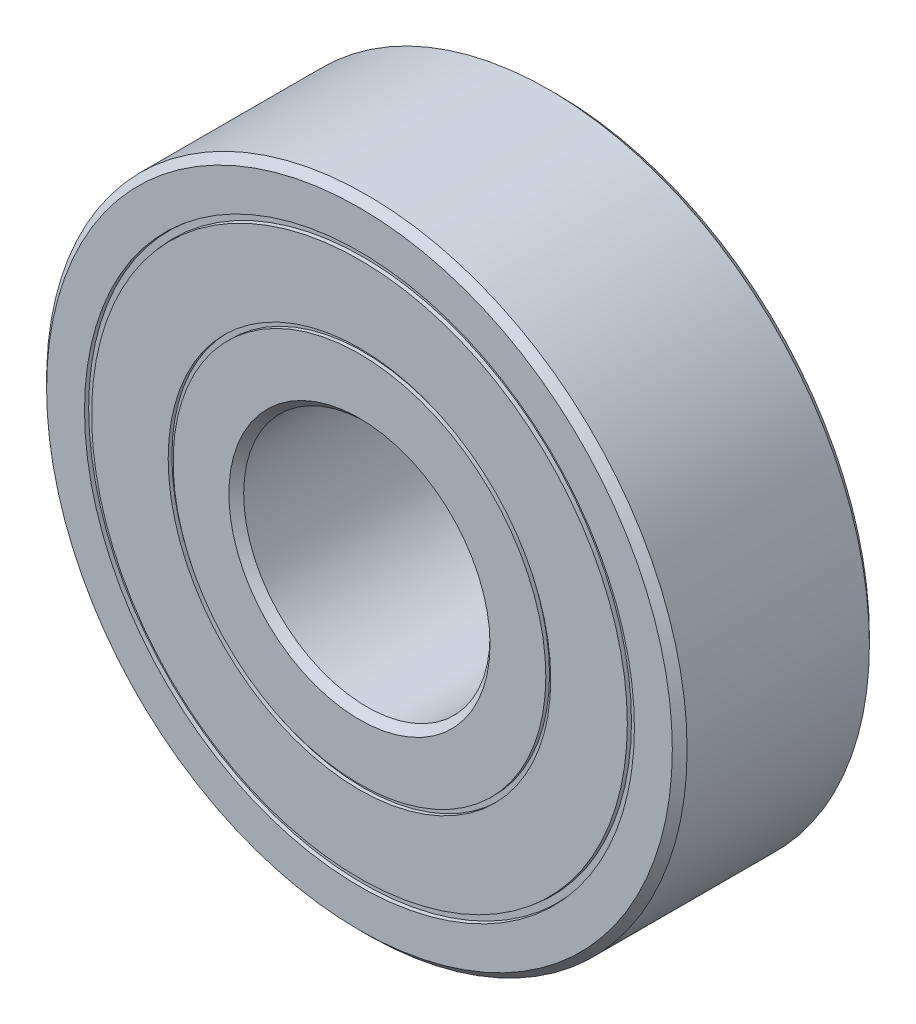
ISO-10303-21;
HEADER;
FILE_DESCRIPTION(('STEP AP214'),'2;1');
FILE_NAME('part.step','',(''),(''),'','','');
FILE_SCHEMA(('AUTOMOTIVE_DESIGN { 1 0 10303 214 1 1 1 1 }'));
ENDSEC;
DATA;
#1=APPLICATION_CONTEXT('core data for automotive mechanical design processes');
#2=APPLICATION_PROTOCOL_DEFINITION('international standard','automotive_design',2000,#1);
#3=PRODUCT_CONTEXT('',#1,'mechanical');
#4=PRODUCT('Part','Part','',(#3));
#5=PRODUCT_RELATED_PRODUCT_CATEGORY('part','',(#4));
#6=PRODUCT_DEFINITION_FORMATION('','',#4);
#7=PRODUCT_DEFINITION_CONTEXT('part definition',#1,'design');
#8=PRODUCT_DEFINITION('design','',#6,#7);
#9=PRODUCT_DEFINITION_SHAPE('','',#8);
#10=(LENGTH_UNIT() NAMED_UNIT(*) SI_UNIT(.MILLI.,.METRE.));
#11=(NAMED_UNIT(*) PLANE_ANGLE_UNIT() SI_UNIT($,.RADIAN.));
#12=(NAMED_UNIT(*) SI_UNIT($,.STERADIAN.) SOLID_ANGLE_UNIT());
#13=UNCERTAINTY_MEASURE_WITH_UNIT(LENGTH_MEASURE(1.E-05),#10,'distance_accuracy_value','');
#14=(GEOMETRIC_REPRESENTATION_CONTEXT(3) GLOBAL_UNCERTAINTY_ASSIGNED_CONTEXT((#13)) GLOBAL_UNIT_ASSIGNED_CONTEXT((#10,
#11,#12)) REPRESENTATION_CONTEXT('',''));
#15=CARTESIAN_POINT('',(0.,0.,0.));
#16=DIRECTION('',(0.,0.,1.));
#17=DIRECTION('',(1.,0.,0.));
#18=AXIS2_PLACEMENT_3D('',#15,#16,#17);
#19=CARTESIAN_POINT('',(0.,0.,8.));
#20=DIRECTION('',(0.,0.,1.));
#21=DIRECTION('',(1.,0.,0.));
#22=AXIS2_PLACEMENT_3D('',#19,#20,#21);
#23=PLANE('',#22);
#24=CARTESIAN_POINT('',(0.,0.,8.));
#25=DIRECTION('',(0.,0.,1.));
#26=DIRECTION('',(1.,0.,0.));
#27=AXIS2_PLACEMENT_3D('',#24,#25,#26);
#28=CIRCLE('',#27,5.3);
#29=CARTESIAN_POINT('',(5.3,0.,8.));
#30=VERTEX_POINT('',#29);
#31=EDGE_CURVE('E48',#30,#30,#28,.F.);
#32=ORIENTED_EDGE('',*,*,#31,.T.);
#33=EDGE_LOOP('',(#32));
#34=FACE_BOUND('',#33,.T.);
#35=CARTESIAN_POINT('',(0.,0.,8.));
#36=DIRECTION('',(0.,0.,1.));
#37=DIRECTION('',(1.,0.,0.));
#38=AXIS2_PLACEMENT_3D('',#35,#36,#37);
#39=CIRCLE('',#38,7.56507306488838);
#40=CARTESIAN_POINT('',(7.56507306488838,0.,8.));
#41=VERTEX_POINT('',#40);
#42=EDGE_CURVE('E39',#41,#41,#39,.T.);
#43=ORIENTED_EDGE('',*,*,#42,.T.);
#44=EDGE_LOOP('',(#43));
#45=FACE_BOUND('',#44,.T.);
#46=ADVANCED_FACE('F35',(#34,#45),#23,.T.);
#47=CARTESIAN_POINT('',(0.,0.,8.));
#48=DIRECTION('',(0.,0.,1.));
#49=DIRECTION('',(1.,0.,0.));
#50=AXIS2_PLACEMENT_3D('',#47,#48,#49);
#51=CIRCLE('',#50,10.873755127897);
#52=CARTESIAN_POINT('',(10.873755127897,0.,8.));
#53=VERTEX_POINT('',#52);
#54=EDGE_CURVE('E52',#53,#53,#51,.T.);
#55=ORIENTED_EDGE('',*,*,#54,.T.);
#56=EDGE_LOOP('',(#55));
#57=FACE_BOUND('',#56,.T.);
#58=CARTESIAN_POINT('',(0.,0.,8.));
#59=DIRECTION('',(0.,0.,1.));
#60=DIRECTION('',(1.,0.,0.));
#61=AXIS2_PLACEMENT_3D('',#58,#59,#60);
#62=CIRCLE('',#61,7.76507306488838);
#63=CARTESIAN_POINT('',(7.76507306488838,0.,8.));
#64=VERTEX_POINT('',#63);
#65=EDGE_CURVE('E75',#64,#64,#62,.F.);
#66=ORIENTED_EDGE('',*,*,#65,.T.);
#67=EDGE_LOOP('',(#66));
#68=FACE_BOUND('',#67,.T.);
#69=ADVANCED_FACE('F144',(#57,#68),#23,.T.);
#70=CARTESIAN_POINT('',(0.,0.,0.));
#71=DIRECTION('',(0.,0.,1.));
#72=DIRECTION('',(1.,0.,0.));
#73=AXIS2_PLACEMENT_3D('',#70,#71,#72);
#74=PLANE('',#73);
#75=CARTESIAN_POINT('',(0.,0.,0.));
#76=DIRECTION('',(0.,0.,1.));
#77=DIRECTION('',(1.,0.,0.));
#78=AXIS2_PLACEMENT_3D('',#75,#76,#77);
#79=CIRCLE('',#78,10.873755127897);
#80=CARTESIAN_POINT('',(10.873755127897,0.,0.));
#81=VERTEX_POINT('',#80);
#82=EDGE_CURVE('E63',#81,#81,#79,.T.);
#83=ORIENTED_EDGE('',*,*,#82,.F.);
#84=EDGE_LOOP('',(#83));
#85=FACE_BOUND('',#84,.T.);
#86=CARTESIAN_POINT('',(0.,0.,0.));
#87=DIRECTION('',(0.,0.,1.));
#88=DIRECTION('',(1.,0.,0.));
#89=AXIS2_PLACEMENT_3D('',#86,#87,#88);
#90=CIRCLE('',#89,7.76507306488838);
#91=CARTESIAN_POINT('',(7.76507306488838,0.,0.));
#92=VERTEX_POINT('',#91);
#93=EDGE_CURVE('E71',#92,#92,#90,.F.);
#94=ORIENTED_EDGE('',*,*,#93,.F.);
#95=EDGE_LOOP('',(#94));
#96=FACE_BOUND('',#95,.T.);
#97=ADVANCED_FACE('F148',(#85,#96),#74,.F.);
#98=CARTESIAN_POINT('',(0.,0.,0.));
#99=DIRECTION('',(0.,0.,1.));
#100=DIRECTION('',(1.,0.,0.));
#101=AXIS2_PLACEMENT_3D('',#98,#99,#100);
#102=CIRCLE('',#101,5.29999999999999);
#103=CARTESIAN_POINT('',(5.29999999999999,0.,0.));
#104=VERTEX_POINT('',#103);
#105=EDGE_CURVE('E104',#104,#104,#102,.T.);
#106=ORIENTED_EDGE('',*,*,#105,.T.);
#107=EDGE_LOOP('',(#106));
#108=FACE_BOUND('',#107,.T.);
#109=CARTESIAN_POINT('',(0.,0.,0.));
#110=DIRECTION('',(0.,0.,1.));
#111=DIRECTION('',(1.,0.,0.));
#112=AXIS2_PLACEMENT_3D('',#109,#110,#111);
#113=CIRCLE('',#112,7.56507306488838);
#114=CARTESIAN_POINT('',(7.56507306488838,0.,0.));
#115=VERTEX_POINT('',#114);
#116=EDGE_CURVE('E68',#115,#115,#113,.T.);
#117=ORIENTED_EDGE('',*,*,#116,.F.);
#118=EDGE_LOOP('',(#117));
#119=FACE_BOUND('',#118,.T.);
#120=ADVANCED_FACE('F157',(#108,#119),#74,.F.);
#121=CARTESIAN_POINT('',(0.,0.,0.));
#122=DIRECTION('',(0.,0.,1.));
#123=DIRECTION('',(1.,0.,0.));
#124=AXIS2_PLACEMENT_3D('',#121,#122,#123);
#125=CIRCLE('',#124,12.7);
#126=CARTESIAN_POINT('',(12.7,0.,0.));
#127=VERTEX_POINT('',#126);
#128=EDGE_CURVE('E59',#127,#127,#125,.F.);
#129=ORIENTED_EDGE('',*,*,#128,.T.);
#130=EDGE_LOOP('',(#129));
#131=FACE_BOUND('',#130,.T.);
#132=CARTESIAN_POINT('',(0.,0.,0.));
#133=DIRECTION('',(0.,0.,1.));
#134=DIRECTION('',(1.,0.,0.));
#135=AXIS2_PLACEMENT_3D('',#132,#133,#134);
#136=CIRCLE('',#135,11.161255127897);
#137=CARTESIAN_POINT('',(11.161255127897,0.,0.));
#138=VERTEX_POINT('',#137);
#139=EDGE_CURVE('E60',#138,#138,#136,.F.);
#140=ORIENTED_EDGE('',*,*,#139,.F.);
#141=EDGE_LOOP('',(#140));
#142=FACE_BOUND('',#141,.T.);
#143=ADVANCED_FACE('F152',(#131,#142),#74,.F.);
#144=CARTESIAN_POINT('',(0.,0.,8.));
#145=DIRECTION('',(0.,0.,1.));
#146=DIRECTION('',(1.,0.,0.));
#147=AXIS2_PLACEMENT_3D('',#144,#145,#146);
#148=CIRCLE('',#147,12.7);
#149=CARTESIAN_POINT('',(12.7,0.,8.));
#150=VERTEX_POINT('',#149);
#151=EDGE_CURVE('E113',#150,#150,#148,.T.);
#152=ORIENTED_EDGE('',*,*,#151,.T.);
#153=EDGE_LOOP('',(#152));
#154=FACE_BOUND('',#153,.T.);
#155=CARTESIAN_POINT('',(0.,0.,8.));
#156=DIRECTION('',(0.,0.,1.));
#157=DIRECTION('',(1.,0.,0.));
#158=AXIS2_PLACEMENT_3D('',#155,#156,#157);
#159=CIRCLE('',#158,11.161255127897);
#160=CARTESIAN_POINT('',(11.161255127897,0.,8.));
#161=VERTEX_POINT('',#160);
#162=EDGE_CURVE('E55',#161,#161,#159,.F.);
#163=ORIENTED_EDGE('',*,*,#162,.T.);
#164=EDGE_LOOP('',(#163));
#165=FACE_BOUND('',#164,.T.);
#166=ADVANCED_FACE('F139',(#154,#165),#23,.T.);
#167=CARTESIAN_POINT('',(0.,0.,8.));
#168=DIRECTION('',(0.,0.,-1.));
#169=DIRECTION('',(-1.,0.,0.));
#170=AXIS2_PLACEMENT_3D('',#167,#168,#169);
#171=CYLINDRICAL_SURFACE('',#170,13.);
#172=CARTESIAN_POINT('',(0.,0.,0.300000000000002));
#173=DIRECTION('',(0.,0.,1.));
#174=DIRECTION('',(1.,0.,0.));
#175=AXIS2_PLACEMENT_3D('',#172,#173,#174);
#176=CIRCLE('',#175,13.);
#177=CARTESIAN_POINT('',(13.,0.,0.300000000000002));
#178=VERTEX_POINT('',#177);
#179=EDGE_CURVE('E10',#178,#178,#176,.T.);
#180=ORIENTED_EDGE('',*,*,#179,.T.);
#181=EDGE_LOOP('',(#180));
#182=FACE_BOUND('',#181,.T.);
#183=CARTESIAN_POINT('',(0.,0.,7.7));
#184=DIRECTION('',(0.,0.,1.));
#185=DIRECTION('',(1.,0.,0.));
#186=AXIS2_PLACEMENT_3D('',#183,#184,#185);
#187=CIRCLE('',#186,13.);
#188=CARTESIAN_POINT('',(13.,0.,7.7));
#189=VERTEX_POINT('',#188);
#190=EDGE_CURVE('E43',#189,#189,#187,.F.);
#191=ORIENTED_EDGE('',*,*,#190,.T.);
#192=EDGE_LOOP('',(#191));
#193=FACE_BOUND('',#192,.T.);
#194=ADVANCED_FACE('F130',(#182,#193),#171,.T.);
#195=CARTESIAN_POINT('',(0.,0.,8.));
#196=DIRECTION('',(0.,0.,-1.));
#197=DIRECTION('',(-1.,0.,0.));
#198=AXIS2_PLACEMENT_3D('',#195,#196,#197);
#199=CYLINDRICAL_SURFACE('',#198,5.);
#200=CARTESIAN_POINT('',(0.,0.,0.299999999999996));
#201=DIRECTION('',(0.,0.,1.));
#202=DIRECTION('',(1.,0.,0.));
#203=AXIS2_PLACEMENT_3D('',#200,#201,#202);
#204=CIRCLE('',#203,5.);
#205=CARTESIAN_POINT('',(5.,0.,0.299999999999996));
#206=VERTEX_POINT('',#205);
#207=EDGE_CURVE('E110',#206,#206,#204,.F.);
#208=ORIENTED_EDGE('',*,*,#207,.T.);
#209=EDGE_LOOP('',(#208));
#210=FACE_BOUND('',#209,.T.);
#211=CARTESIAN_POINT('',(0.,0.,7.70000000000001));
#212=DIRECTION('',(0.,0.,1.));
#213=DIRECTION('',(1.,0.,0.));
#214=AXIS2_PLACEMENT_3D('',#211,#212,#213);
#215=CIRCLE('',#214,5.);
#216=CARTESIAN_POINT('',(5.,0.,7.70000000000001));
#217=VERTEX_POINT('',#216);
#218=EDGE_CURVE('E107',#217,#217,#215,.T.);
#219=ORIENTED_EDGE('',*,*,#218,.T.);
#220=EDGE_LOOP('',(#219));
#221=FACE_BOUND('',#220,.T.);
#222=ADVANCED_FACE('F128',(#210,#221),#199,.F.);
#223=CARTESIAN_POINT('',(0.,0.,0.));
#224=DIRECTION('',(0.,0.,-1.));
#225=DIRECTION('',(-1.,0.,0.));
#226=AXIS2_PLACEMENT_3D('',#223,#224,#225);
#227=CONICAL_SURFACE('',#226,5.29999999999999,0.785398163397443);
#228=ORIENTED_EDGE('',*,*,#207,.F.);
#229=EDGE_LOOP('',(#228));
#230=FACE_BOUND('',#229,.T.);
#231=ORIENTED_EDGE('',*,*,#105,.F.);
#232=EDGE_LOOP('',(#231));
#233=FACE_BOUND('',#232,.T.);
#234=ADVANCED_FACE('F124',(#230,#233),#227,.F.);
#235=CARTESIAN_POINT('',(0.,0.,7.70000000000001));
#236=DIRECTION('',(0.,0.,1.));
#237=DIRECTION('',(1.,0.,0.));
#238=AXIS2_PLACEMENT_3D('',#235,#236,#237);
#239=CONICAL_SURFACE('',#238,5.,0.785398163397461);
#240=ORIENTED_EDGE('',*,*,#31,.F.);
#241=EDGE_LOOP('',(#240));
#242=FACE_BOUND('',#241,.T.);
#243=ORIENTED_EDGE('',*,*,#218,.F.);
#244=EDGE_LOOP('',(#243));
#245=FACE_BOUND('',#244,.T.);
#246=ADVANCED_FACE('F120',(#242,#245),#239,.F.);
#247=CARTESIAN_POINT('',(0.,0.,0.300000000000002));
#248=DIRECTION('',(0.,0.,1.));
#249=DIRECTION('',(1.,0.,0.));
#250=AXIS2_PLACEMENT_3D('',#247,#248,#249);
#251=CONICAL_SURFACE('',#250,13.,0.785398163397451);
#252=ORIENTED_EDGE('',*,*,#128,.F.);
#253=EDGE_LOOP('',(#252));
#254=FACE_BOUND('',#253,.T.);
#255=ORIENTED_EDGE('',*,*,#179,.F.);
#256=EDGE_LOOP('',(#255));
#257=FACE_BOUND('',#256,.T.);
#258=ADVANCED_FACE('F123',(#254,#257),#251,.T.);
#259=CARTESIAN_POINT('',(0.,0.,8.));
#260=DIRECTION('',(0.,0.,-1.));
#261=DIRECTION('',(-1.,0.,0.));
#262=AXIS2_PLACEMENT_3D('',#259,#260,#261);
#263=CONICAL_SURFACE('',#262,12.7,0.785398163397445);
#264=ORIENTED_EDGE('',*,*,#190,.F.);
#265=EDGE_LOOP('',(#264));
#266=FACE_BOUND('',#265,.T.);
#267=ORIENTED_EDGE('',*,*,#151,.F.);
#268=EDGE_LOOP('',(#267));
#269=FACE_BOUND('',#268,.T.);
#270=ADVANCED_FACE('F37',(#266,#269),#263,.T.);
#271=CARTESIAN_POINT('',(0.,0.,7.85));
#272=DIRECTION('',(0.,0.,1.));
#273=DIRECTION('',(1.,0.,0.));
#274=AXIS2_PLACEMENT_3D('',#271,#272,#273);
#275=CONICAL_SURFACE('',#274,11.142505127897,0.124354994546761);
#276=ORIENTED_EDGE('',*,*,#162,.F.);
#277=EDGE_LOOP('',(#276));
#278=FACE_BOUND('',#277,.T.);
#279=CARTESIAN_POINT('',(0.,0.,7.85));
#280=DIRECTION('',(0.,0.,1.));
#281=DIRECTION('',(1.,0.,0.));
#282=AXIS2_PLACEMENT_3D('',#279,#280,#281);
#283=CIRCLE('',#282,11.142505127897);
#284=CARTESIAN_POINT('',(11.142505127897,0.,7.85));
#285=VERTEX_POINT('',#284);
#286=EDGE_CURVE('E56',#285,#285,#283,.T.);
#287=ORIENTED_EDGE('',*,*,#286,.F.);
#288=EDGE_LOOP('',(#287));
#289=FACE_BOUND('',#288,.T.);
#290=ADVANCED_FACE('F163',(#278,#289),#275,.F.);
#291=CARTESIAN_POINT('',(0.,11.142505127897,7.85));
#292=DIRECTION('',(0.,0.,1.));
#293=DIRECTION('',(1.,0.,0.));
#294=AXIS2_PLACEMENT_3D('',#291,#292,#293);
#295=PLANE('',#294);
#296=ORIENTED_EDGE('',*,*,#286,.T.);
#297=EDGE_LOOP('',(#296));
#298=FACE_BOUND('',#297,.T.);
#299=CARTESIAN_POINT('',(0.,0.,7.85));
#300=DIRECTION('',(0.,0.,1.));
#301=DIRECTION('',(1.,0.,0.));
#302=AXIS2_PLACEMENT_3D('',#299,#300,#301);
#303=CIRCLE('',#302,10.892505127897);
#304=CARTESIAN_POINT('',(10.892505127897,0.,7.85));
#305=VERTEX_POINT('',#304);
#306=EDGE_CURVE('E67',#305,#305,#303,.T.);
#307=ORIENTED_EDGE('',*,*,#306,.F.);
#308=EDGE_LOOP('',(#307));
#309=FACE_BOUND('',#308,.T.);
#310=ADVANCED_FACE('F166',(#298,#309),#295,.T.);
#311=CARTESIAN_POINT('',(0.,0.,8.85));
#312=DIRECTION('',(0.,0.,-1.));
#313=DIRECTION('',(-1.,0.,0.));
#314=AXIS2_PLACEMENT_3D('',#311,#312,#313);
#315=CONICAL_SURFACE('',#314,10.767505127897,0.124354994546761);
#316=ORIENTED_EDGE('',*,*,#54,.F.);
#317=EDGE_LOOP('',(#316));
#318=FACE_BOUND('',#317,.T.);
#319=ORIENTED_EDGE('',*,*,#306,.T.);
#320=EDGE_LOOP('',(#319));
#321=FACE_BOUND('',#320,.T.);
#322=ADVANCED_FACE('F171',(#318,#321),#315,.T.);
#323=CARTESIAN_POINT('',(0.,0.,0.150000000000003));
#324=DIRECTION('',(0.,0.,1.));
#325=DIRECTION('',(1.,0.,0.));
#326=AXIS2_PLACEMENT_3D('',#323,#324,#325);
#327=CONICAL_SURFACE('',#326,10.892505127897,0.12435499454676);
#328=CARTESIAN_POINT('',(0.,0.,0.150000000000003));
#329=DIRECTION('',(0.,0.,1.));
#330=DIRECTION('',(1.,0.,0.));
#331=AXIS2_PLACEMENT_3D('',#328,#329,#330);
#332=CIRCLE('',#331,10.892505127897);
#333=CARTESIAN_POINT('',(10.892505127897,0.,0.150000000000003));
#334=VERTEX_POINT('',#333);
#335=EDGE_CURVE('E74',#334,#334,#332,.T.);
#336=ORIENTED_EDGE('',*,*,#335,.F.);
#337=EDGE_LOOP('',(#336));
#338=FACE_BOUND('',#337,.T.);
#339=ORIENTED_EDGE('',*,*,#82,.T.);
#340=EDGE_LOOP('',(#339));
#341=FACE_BOUND('',#340,.T.);
#342=ADVANCED_FACE('F176',(#338,#341),#327,.T.);
#343=CARTESIAN_POINT('',(0.,0.,-0.849999999999998));
#344=DIRECTION('',(0.,0.,-1.));
#345=DIRECTION('',(-1.,0.,0.));
#346=AXIS2_PLACEMENT_3D('',#343,#344,#345);
#347=CONICAL_SURFACE('',#346,11.267505127897,0.124354994546761);
#348=CARTESIAN_POINT('',(0.,0.,0.150000000000003));
#349=DIRECTION('',(0.,0.,1.));
#350=DIRECTION('',(1.,0.,0.));
#351=AXIS2_PLACEMENT_3D('',#348,#349,#350);
#352=CIRCLE('',#351,11.142505127897);
#353=CARTESIAN_POINT('',(11.142505127897,0.,0.150000000000003));
#354=VERTEX_POINT('',#353);
#355=EDGE_CURVE('E64',#354,#354,#352,.T.);
#356=ORIENTED_EDGE('',*,*,#355,.T.);
#357=EDGE_LOOP('',(#356));
#358=FACE_BOUND('',#357,.T.);
#359=ORIENTED_EDGE('',*,*,#139,.T.);
#360=EDGE_LOOP('',(#359));
#361=FACE_BOUND('',#360,.T.);
#362=ADVANCED_FACE('F182',(#358,#361),#347,.F.);
#363=CARTESIAN_POINT('',(0.,11.142505127897,0.150000000000003));
#364=DIRECTION('',(0.,0.,-1.));
#365=DIRECTION('',(-1.,0.,0.));
#366=AXIS2_PLACEMENT_3D('',#363,#364,#365);
#367=PLANE('',#366);
#368=ORIENTED_EDGE('',*,*,#335,.T.);
#369=EDGE_LOOP('',(#368));
#370=FACE_BOUND('',#369,.T.);
#371=ORIENTED_EDGE('',*,*,#355,.F.);
#372=EDGE_LOOP('',(#371));
#373=FACE_BOUND('',#372,.T.);
#374=ADVANCED_FACE('F189',(#370,#373),#367,.T.);
#375=CARTESIAN_POINT('',(0.,0.,12.4113492427966));
#376=DIRECTION('',(0.,0.,1.));
#377=DIRECTION('',(1.,0.,0.));
#378=AXIS2_PLACEMENT_3D('',#375,#376,#377);
#379=CYLINDRICAL_SURFACE('',#378,7.76507306488838);
#380=CARTESIAN_POINT('',(0.,0.,0.150000000000003));
#381=DIRECTION('',(0.,0.,1.));
#382=DIRECTION('',(1.,0.,0.));
#383=AXIS2_PLACEMENT_3D('',#380,#381,#382);
#384=CIRCLE('',#383,7.76507306488838);
#385=CARTESIAN_POINT('',(7.76507306488838,0.,0.150000000000003));
#386=VERTEX_POINT('',#385);
#387=EDGE_CURVE('E72',#386,#386,#384,.T.);
#388=ORIENTED_EDGE('',*,*,#387,.T.);
#389=EDGE_LOOP('',(#388));
#390=FACE_BOUND('',#389,.T.);
#391=ORIENTED_EDGE('',*,*,#93,.T.);
#392=EDGE_LOOP('',(#391));
#393=FACE_BOUND('',#392,.T.);
#394=ADVANCED_FACE('F193',(#390,#393),#379,.F.);
#395=CARTESIAN_POINT('',(0.,0.,12.4113492427966));
#396=DIRECTION('',(0.,0.,1.));
#397=DIRECTION('',(1.,0.,0.));
#398=AXIS2_PLACEMENT_3D('',#395,#396,#397);
#399=CYLINDRICAL_SURFACE('',#398,7.56507306488838);
#400=CARTESIAN_POINT('',(0.,0.,0.150000000000003));
#401=DIRECTION('',(0.,0.,1.));
#402=DIRECTION('',(1.,0.,0.));
#403=AXIS2_PLACEMENT_3D('',#400,#401,#402);
#404=CIRCLE('',#403,7.56507306488838);
#405=CARTESIAN_POINT('',(7.56507306488838,0.,0.150000000000003));
#406=VERTEX_POINT('',#405);
#407=EDGE_CURVE('E81',#406,#406,#404,.T.);
#408=ORIENTED_EDGE('',*,*,#407,.F.);
#409=EDGE_LOOP('',(#408));
#410=FACE_BOUND('',#409,.T.);
#411=ORIENTED_EDGE('',*,*,#116,.T.);
#412=EDGE_LOOP('',(#411));
#413=FACE_BOUND('',#412,.T.);
#414=ADVANCED_FACE('F197',(#410,#413),#399,.T.);
#415=CARTESIAN_POINT('',(0.,7.76507306488838,0.150000000000003));
#416=DIRECTION('',(0.,0.,-1.));
#417=DIRECTION('',(-1.,0.,0.));
#418=AXIS2_PLACEMENT_3D('',#415,#416,#417);
#419=PLANE('',#418);
#420=ORIENTED_EDGE('',*,*,#407,.T.);
#421=EDGE_LOOP('',(#420));
#422=FACE_BOUND('',#421,.T.);
#423=ORIENTED_EDGE('',*,*,#387,.F.);
#424=EDGE_LOOP('',(#423));
#425=FACE_BOUND('',#424,.T.);
#426=ADVANCED_FACE('F199',(#422,#425),#419,.T.);
#427=CARTESIAN_POINT('',(0.,0.,12.4113492427966));
#428=DIRECTION('',(0.,0.,1.));
#429=DIRECTION('',(1.,0.,0.));
#430=AXIS2_PLACEMENT_3D('',#427,#428,#429);
#431=CYLINDRICAL_SURFACE('',#430,7.56507306488838);
#432=ORIENTED_EDGE('',*,*,#42,.F.);
#433=EDGE_LOOP('',(#432));
#434=FACE_BOUND('',#433,.T.);
#435=CARTESIAN_POINT('',(0.,0.,7.85));
#436=DIRECTION('',(0.,0.,1.));
#437=DIRECTION('',(1.,0.,0.));
#438=AXIS2_PLACEMENT_3D('',#435,#436,#437);
#439=CIRCLE('',#438,7.56507306488838);
#440=CARTESIAN_POINT('',(7.56507306488838,0.,7.85));
#441=VERTEX_POINT('',#440);
#442=EDGE_CURVE('E77',#441,#441,#439,.T.);
#443=ORIENTED_EDGE('',*,*,#442,.T.);
#444=EDGE_LOOP('',(#443));
#445=FACE_BOUND('',#444,.T.);
#446=ADVANCED_FACE('F202',(#434,#445),#431,.T.);
#447=CARTESIAN_POINT('',(0.,7.76507306488838,7.85));
#448=DIRECTION('',(0.,0.,1.));
#449=DIRECTION('',(1.,0.,0.));
#450=AXIS2_PLACEMENT_3D('',#447,#448,#449);
#451=PLANE('',#450);
#452=CARTESIAN_POINT('',(0.,0.,7.85));
#453=DIRECTION('',(0.,0.,1.));
#454=DIRECTION('',(1.,0.,0.));
#455=AXIS2_PLACEMENT_3D('',#452,#453,#454);
#456=CIRCLE('',#455,7.76507306488838);
#457=CARTESIAN_POINT('',(7.76507306488838,0.,7.85));
#458=VERTEX_POINT('',#457);
#459=EDGE_CURVE('E83',#458,#458,#456,.T.);
#460=ORIENTED_EDGE('',*,*,#459,.T.);
#461=EDGE_LOOP('',(#460));
#462=FACE_BOUND('',#461,.T.);
#463=ORIENTED_EDGE('',*,*,#442,.F.);
#464=EDGE_LOOP('',(#463));
#465=FACE_BOUND('',#464,.T.);
#466=ADVANCED_FACE('F209',(#462,#465),#451,.T.);
#467=CARTESIAN_POINT('',(0.,0.,12.4113492427966));
#468=DIRECTION('',(0.,0.,1.));
#469=DIRECTION('',(1.,0.,0.));
#470=AXIS2_PLACEMENT_3D('',#467,#468,#469);
#471=CYLINDRICAL_SURFACE('',#470,7.76507306488838);
#472=ORIENTED_EDGE('',*,*,#65,.F.);
#473=EDGE_LOOP('',(#472));
#474=FACE_BOUND('',#473,.T.);
#475=ORIENTED_EDGE('',*,*,#459,.F.);
#476=EDGE_LOOP('',(#475));
#477=FACE_BOUND('',#476,.T.);
#478=ADVANCED_FACE('F213',(#474,#477),#471,.F.);
#479=CLOSED_SHELL('',(#46,#69,#97,#120,#143,#166,#194,#222,#234,#246,#258,#270,#290,#310,#322,
#342,#362,#374,#394,#414,#426,#446,#466,#478));
#480=MANIFOLD_SOLID_BREP('B2',#479);
#481=ADVANCED_BREP_SHAPE_REPRESENTATION('',(#18,#480),#14);
#482=SHAPE_DEFINITION_REPRESENTATION(#9,#481);
ENDSEC;
END-ISO-10303-21;
